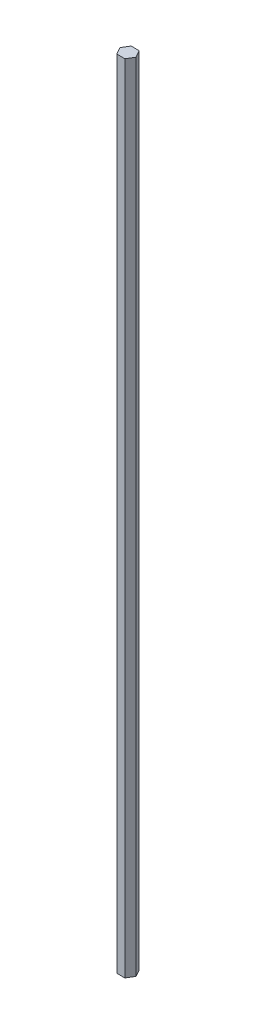
ISO-10303-21;
HEADER;
FILE_DESCRIPTION(('STEP AP214'),'2;1');
FILE_NAME('part.step','',(''),(''),'','','');
FILE_SCHEMA(('AUTOMOTIVE_DESIGN { 1 0 10303 214 1 1 1 1 }'));
ENDSEC;
DATA;
#1=APPLICATION_CONTEXT('core data for automotive mechanical design processes');
#2=APPLICATION_PROTOCOL_DEFINITION('international standard','automotive_design',2000,#1);
#3=PRODUCT_CONTEXT('',#1,'mechanical');
#4=PRODUCT('Part','Part','',(#3));
#5=PRODUCT_RELATED_PRODUCT_CATEGORY('part','',(#4));
#6=PRODUCT_DEFINITION_FORMATION('','',#4);
#7=PRODUCT_DEFINITION_CONTEXT('part definition',#1,'design');
#8=PRODUCT_DEFINITION('design','',#6,#7);
#9=PRODUCT_DEFINITION_SHAPE('','',#8);
#10=(LENGTH_UNIT() NAMED_UNIT(*) SI_UNIT(.MILLI.,.METRE.));
#11=(NAMED_UNIT(*) PLANE_ANGLE_UNIT() SI_UNIT($,.RADIAN.));
#12=(NAMED_UNIT(*) SI_UNIT($,.STERADIAN.) SOLID_ANGLE_UNIT());
#13=UNCERTAINTY_MEASURE_WITH_UNIT(LENGTH_MEASURE(1.E-05),#10,'distance_accuracy_value','');
#14=(GEOMETRIC_REPRESENTATION_CONTEXT(3) GLOBAL_UNCERTAINTY_ASSIGNED_CONTEXT((#13)) GLOBAL_UNIT_ASSIGNED_CONTEXT((#10,
#11,#12)) REPRESENTATION_CONTEXT('',''));
#15=CARTESIAN_POINT('',(0.,0.,0.));
#16=DIRECTION('',(0.,0.,1.));
#17=DIRECTION('',(1.,0.,0.));
#18=AXIS2_PLACEMENT_3D('',#15,#16,#17);
#19=CARTESIAN_POINT('',(-3.94753482122291,660.4,5.18786888068424));
#20=DIRECTION('',(0.0164995224917249,0.,-0.999863873613576));
#21=DIRECTION('',(-0.999863873613576,0.,-0.0164995224917249));
#22=AXIS2_PLACEMENT_3D('',#19,#20,#21);
#23=PLANE('',#22);
#24=DIRECTION('',(0.999863873613576,0.,0.0164995224917249));
#25=VECTOR('',#24,1.);
#26=CARTESIAN_POINT('',(-3.94753482122291,0.,5.18786888068424));
#27=LINE('',#26,#25);
#28=CARTESIAN_POINT('',(-3.94753482122291,0.,5.18786888068424));
#29=VERTEX_POINT('',#28);
#30=CARTESIAN_POINT('',(2.79778683750394,0.,5.29917861929882));
#31=VERTEX_POINT('',#30);
#32=EDGE_CURVE('E128',#29,#31,#27,.T.);
#33=ORIENTED_EDGE('',*,*,#32,.T.);
#34=DIRECTION('',(0.,-1.,0.));
#35=VECTOR('',#34,1.);
#36=CARTESIAN_POINT('',(2.79778683750394,660.4,5.29917861929882));
#37=LINE('',#36,#35);
#38=CARTESIAN_POINT('',(2.79778683750394,660.4,5.29917861929882));
#39=VERTEX_POINT('',#38);
#40=EDGE_CURVE('E11',#39,#31,#37,.T.);
#41=ORIENTED_EDGE('',*,*,#40,.F.);
#42=DIRECTION('',(0.999863873613576,0.,0.0164995224917249));
#43=VECTOR('',#42,1.);
#44=CARTESIAN_POINT('',(-3.94753482122291,660.4,5.18786888068424));
#45=LINE('',#44,#43);
#46=CARTESIAN_POINT('',(-3.94753482122291,660.4,5.18786888068424));
#47=VERTEX_POINT('',#46);
#48=EDGE_CURVE('E144',#47,#39,#45,.T.);
#49=ORIENTED_EDGE('',*,*,#48,.F.);
#50=DIRECTION('',(0.,-1.,0.));
#51=VECTOR('',#50,1.);
#52=CARTESIAN_POINT('',(-3.94753482122291,660.4,5.18786888068424));
#53=LINE('',#52,#51);
#54=EDGE_CURVE('E124',#47,#29,#53,.T.);
#55=ORIENTED_EDGE('',*,*,#54,.T.);
#56=EDGE_LOOP('',(#33,#41,#49,#55));
#57=FACE_BOUND('',#56,.T.);
#58=ADVANCED_FACE('F39',(#57),#23,.F.);
#59=CARTESIAN_POINT('',(2.79778683750394,660.4,5.29917861929882));
#60=DIRECTION('',(-0.857657753629808,0.,-0.514220942434934));
#61=DIRECTION('',(-0.514220942434934,0.,0.857657753629808));
#62=AXIS2_PLACEMENT_3D('',#59,#60,#61);
#63=PLANE('',#62);
#64=DIRECTION('',(0.514220942434934,0.,-0.857657753629808));
#65=VECTOR('',#64,1.);
#66=CARTESIAN_POINT('',(2.79778683750394,0.,5.29917861929882));
#67=LINE('',#66,#65);
#68=CARTESIAN_POINT('',(6.26684472819619,0.,-0.486786424548735));
#69=VERTEX_POINT('',#68);
#70=EDGE_CURVE('E132',#31,#69,#67,.T.);
#71=ORIENTED_EDGE('',*,*,#70,.T.);
#72=DIRECTION('',(0.,-1.,0.));
#73=VECTOR('',#72,1.);
#74=CARTESIAN_POINT('',(6.26684472819619,660.4,-0.486786424548735));
#75=LINE('',#74,#73);
#76=CARTESIAN_POINT('',(6.26684472819619,660.4,-0.486786424548735));
#77=VERTEX_POINT('',#76);
#78=EDGE_CURVE('E48',#77,#69,#75,.T.);
#79=ORIENTED_EDGE('',*,*,#78,.F.);
#80=DIRECTION('',(0.514220942434934,0.,-0.857657753629808));
#81=VECTOR('',#80,1.);
#82=CARTESIAN_POINT('',(2.79778683750394,660.4,5.29917861929882));
#83=LINE('',#82,#81);
#84=EDGE_CURVE('E93',#39,#77,#83,.T.);
#85=ORIENTED_EDGE('',*,*,#84,.F.);
#86=ORIENTED_EDGE('',*,*,#40,.T.);
#87=EDGE_LOOP('',(#71,#79,#85,#86));
#88=FACE_BOUND('',#87,.T.);
#89=ADVANCED_FACE('F172',(#88),#63,.F.);
#90=CARTESIAN_POINT('',(6.26684472819619,660.4,-0.486786424548735));
#91=DIRECTION('',(-0.874157276121532,0.,0.485642931178642));
#92=DIRECTION('',(0.485642931178642,0.,0.874157276121532));
#93=AXIS2_PLACEMENT_3D('',#90,#91,#92);
#94=PLANE('',#93);
#95=DIRECTION('',(-0.485642931178642,0.,-0.874157276121532));
#96=VECTOR('',#95,1.);
#97=CARTESIAN_POINT('',(6.26684472819619,0.,-0.486786424548735));
#98=LINE('',#97,#96);
#99=CARTESIAN_POINT('',(2.99058096016159,0.,-6.38406120701086));
#100=VERTEX_POINT('',#99);
#101=EDGE_CURVE('E135',#69,#100,#98,.T.);
#102=ORIENTED_EDGE('',*,*,#101,.T.);
#103=DIRECTION('',(0.,-1.,0.));
#104=VECTOR('',#103,1.);
#105=CARTESIAN_POINT('',(2.99058096016159,660.4,-6.38406120701086));
#106=LINE('',#105,#104);
#107=CARTESIAN_POINT('',(2.99058096016159,660.4,-6.38406120701086));
#108=VERTEX_POINT('',#107);
#109=EDGE_CURVE('E117',#108,#100,#106,.T.);
#110=ORIENTED_EDGE('',*,*,#109,.F.);
#111=DIRECTION('',(-0.485642931178642,0.,-0.874157276121532));
#112=VECTOR('',#111,1.);
#113=CARTESIAN_POINT('',(6.26684472819619,660.4,-0.486786424548735));
#114=LINE('',#113,#112);
#115=EDGE_CURVE('E106',#77,#108,#114,.T.);
#116=ORIENTED_EDGE('',*,*,#115,.F.);
#117=ORIENTED_EDGE('',*,*,#78,.T.);
#118=EDGE_LOOP('',(#102,#110,#116,#117));
#119=FACE_BOUND('',#118,.T.);
#120=ADVANCED_FACE('F154',(#119),#94,.F.);
#121=CARTESIAN_POINT('',(2.99058096016159,660.4,-6.38406120701086));
#122=DIRECTION('',(-0.016499522491725,0.,0.999863873613576));
#123=DIRECTION('',(0.999863873613576,0.,0.016499522491725));
#124=AXIS2_PLACEMENT_3D('',#121,#122,#123);
#125=PLANE('',#124);
#126=DIRECTION('',(-0.999863873613576,0.,-0.016499522491725));
#127=VECTOR('',#126,1.);
#128=CARTESIAN_POINT('',(2.99058096016159,0.,-6.38406120701086));
#129=LINE('',#128,#127);
#130=CARTESIAN_POINT('',(-3.75474069856525,0.,-6.49537094562543));
#131=VERTEX_POINT('',#130);
#132=EDGE_CURVE('E115',#100,#131,#129,.T.);
#133=ORIENTED_EDGE('',*,*,#132,.T.);
#134=DIRECTION('',(0.,-1.,0.));
#135=VECTOR('',#134,1.);
#136=CARTESIAN_POINT('',(-3.75474069856525,660.4,-6.49537094562543));
#137=LINE('',#136,#135);
#138=CARTESIAN_POINT('',(-3.75474069856525,660.4,-6.49537094562543));
#139=VERTEX_POINT('',#138);
#140=EDGE_CURVE('E112',#139,#131,#137,.T.);
#141=ORIENTED_EDGE('',*,*,#140,.F.);
#142=DIRECTION('',(-0.999863873613576,0.,-0.016499522491725));
#143=VECTOR('',#142,1.);
#144=CARTESIAN_POINT('',(2.99058096016159,660.4,-6.38406120701086));
#145=LINE('',#144,#143);
#146=EDGE_CURVE('E100',#108,#139,#145,.T.);
#147=ORIENTED_EDGE('',*,*,#146,.F.);
#148=ORIENTED_EDGE('',*,*,#109,.T.);
#149=EDGE_LOOP('',(#133,#141,#147,#148));
#150=FACE_BOUND('',#149,.T.);
#151=ADVANCED_FACE('F113',(#150),#125,.F.);
#152=CARTESIAN_POINT('',(-3.75474069856525,660.4,-6.49537094562543));
#153=DIRECTION('',(0.857657753629808,0.,0.514220942434934));
#154=DIRECTION('',(0.514220942434934,0.,-0.857657753629808));
#155=AXIS2_PLACEMENT_3D('',#152,#153,#154);
#156=PLANE('',#155);
#157=DIRECTION('',(-0.514220942434934,0.,0.857657753629808));
#158=VECTOR('',#157,1.);
#159=CARTESIAN_POINT('',(-3.75474069856525,0.,-6.49537094562543));
#160=LINE('',#159,#158);
#161=CARTESIAN_POINT('',(-7.2237985892575,0.,-0.70940590177788));
#162=VERTEX_POINT('',#161);
#163=EDGE_CURVE('E79',#131,#162,#160,.T.);
#164=ORIENTED_EDGE('',*,*,#163,.T.);
#165=DIRECTION('',(0.,-1.,0.));
#166=VECTOR('',#165,1.);
#167=CARTESIAN_POINT('',(-7.2237985892575,660.4,-0.70940590177788));
#168=LINE('',#167,#166);
#169=CARTESIAN_POINT('',(-7.2237985892575,660.4,-0.70940590177788));
#170=VERTEX_POINT('',#169);
#171=EDGE_CURVE('E118',#170,#162,#168,.T.);
#172=ORIENTED_EDGE('',*,*,#171,.F.);
#173=DIRECTION('',(-0.514220942434934,0.,0.857657753629808));
#174=VECTOR('',#173,1.);
#175=CARTESIAN_POINT('',(-3.75474069856525,660.4,-6.49537094562543));
#176=LINE('',#175,#174);
#177=EDGE_CURVE('E104',#139,#170,#176,.T.);
#178=ORIENTED_EDGE('',*,*,#177,.F.);
#179=ORIENTED_EDGE('',*,*,#140,.T.);
#180=EDGE_LOOP('',(#164,#172,#178,#179));
#181=FACE_BOUND('',#180,.T.);
#182=ADVANCED_FACE('F120',(#181),#156,.F.);
#183=CARTESIAN_POINT('',(-7.2237985892575,660.4,-0.70940590177788));
#184=DIRECTION('',(0.874157276121532,0.,-0.485642931178642));
#185=DIRECTION('',(-0.485642931178642,0.,-0.874157276121532));
#186=AXIS2_PLACEMENT_3D('',#183,#184,#185);
#187=PLANE('',#186);
#188=DIRECTION('',(0.485642931178642,0.,0.874157276121532));
#189=VECTOR('',#188,1.);
#190=CARTESIAN_POINT('',(-7.2237985892575,0.,-0.70940590177788));
#191=LINE('',#190,#189);
#192=EDGE_CURVE('E85',#162,#29,#191,.T.);
#193=ORIENTED_EDGE('',*,*,#192,.T.);
#194=ORIENTED_EDGE('',*,*,#54,.F.);
#195=DIRECTION('',(0.485642931178642,0.,0.874157276121532));
#196=VECTOR('',#195,1.);
#197=CARTESIAN_POINT('',(-7.2237985892575,660.4,-0.70940590177788));
#198=LINE('',#197,#196);
#199=EDGE_CURVE('E56',#170,#47,#198,.T.);
#200=ORIENTED_EDGE('',*,*,#199,.F.);
#201=ORIENTED_EDGE('',*,*,#171,.T.);
#202=EDGE_LOOP('',(#193,#194,#200,#201));
#203=FACE_BOUND('',#202,.T.);
#204=ADVANCED_FACE('F161',(#203),#187,.F.);
#205=CARTESIAN_POINT('',(0.,660.4,0.));
#206=DIRECTION('',(0.,1.,0.));
#207=DIRECTION('',(0.,0.,1.));
#208=AXIS2_PLACEMENT_3D('',#205,#206,#207);
#209=PLANE('',#208);
#210=ORIENTED_EDGE('',*,*,#48,.T.);
#211=ORIENTED_EDGE('',*,*,#84,.T.);
#212=ORIENTED_EDGE('',*,*,#115,.T.);
#213=ORIENTED_EDGE('',*,*,#146,.T.);
#214=ORIENTED_EDGE('',*,*,#177,.T.);
#215=ORIENTED_EDGE('',*,*,#199,.T.);
#216=EDGE_LOOP('',(#210,#211,#212,#213,#214,#215));
#217=FACE_BOUND('',#216,.T.);
#218=ADVANCED_FACE('F102',(#217),#209,.T.);
#219=CARTESIAN_POINT('',(0.,0.,0.));
#220=DIRECTION('',(0.,1.,0.));
#221=DIRECTION('',(0.,0.,1.));
#222=AXIS2_PLACEMENT_3D('',#219,#220,#221);
#223=PLANE('',#222);
#224=ORIENTED_EDGE('',*,*,#32,.F.);
#225=ORIENTED_EDGE('',*,*,#192,.F.);
#226=ORIENTED_EDGE('',*,*,#163,.F.);
#227=ORIENTED_EDGE('',*,*,#132,.F.);
#228=ORIENTED_EDGE('',*,*,#101,.F.);
#229=ORIENTED_EDGE('',*,*,#70,.F.);
#230=EDGE_LOOP('',(#224,#225,#226,#227,#228,#229));
#231=FACE_BOUND('',#230,.T.);
#232=ADVANCED_FACE('F157',(#231),#223,.F.);
#233=CLOSED_SHELL('',(#58,#89,#120,#151,#182,#204,#218,#232));
#234=MANIFOLD_SOLID_BREP('B2',#233);
#235=ADVANCED_BREP_SHAPE_REPRESENTATION('',(#18,#234),#14);
#236=SHAPE_DEFINITION_REPRESENTATION(#9,#235);
ENDSEC;
END-ISO-10303-21;
